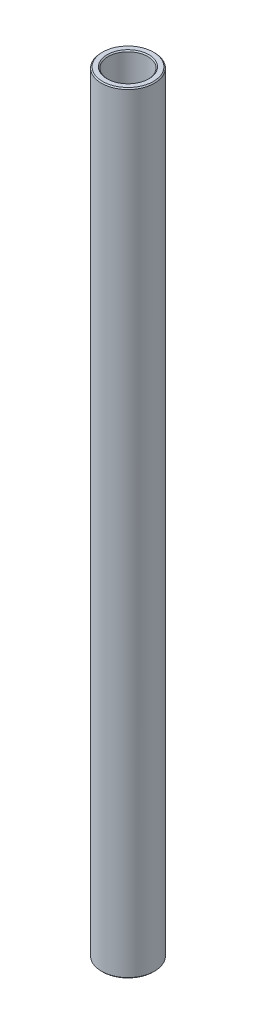
ISO-10303-21;
HEADER;
FILE_DESCRIPTION(('STEP AP214'),'2;1');
FILE_NAME('part.step','',(''),(''),'','','');
FILE_SCHEMA(('AUTOMOTIVE_DESIGN { 1 0 10303 214 1 1 1 1 }'));
ENDSEC;
DATA;
#1=APPLICATION_CONTEXT('core data for automotive mechanical design processes');
#2=APPLICATION_PROTOCOL_DEFINITION('international standard','automotive_design',2000,#1);
#3=PRODUCT_CONTEXT('',#1,'mechanical');
#4=PRODUCT('Part','Part','',(#3));
#5=PRODUCT_RELATED_PRODUCT_CATEGORY('part','',(#4));
#6=PRODUCT_DEFINITION_FORMATION('','',#4);
#7=PRODUCT_DEFINITION_CONTEXT('part definition',#1,'design');
#8=PRODUCT_DEFINITION('design','',#6,#7);
#9=PRODUCT_DEFINITION_SHAPE('','',#8);
#10=(LENGTH_UNIT() NAMED_UNIT(*) SI_UNIT(.MILLI.,.METRE.));
#11=(NAMED_UNIT(*) PLANE_ANGLE_UNIT() SI_UNIT($,.RADIAN.));
#12=(NAMED_UNIT(*) SI_UNIT($,.STERADIAN.) SOLID_ANGLE_UNIT());
#13=UNCERTAINTY_MEASURE_WITH_UNIT(LENGTH_MEASURE(1.E-05),#10,'distance_accuracy_value','');
#14=(GEOMETRIC_REPRESENTATION_CONTEXT(3) GLOBAL_UNCERTAINTY_ASSIGNED_CONTEXT((#13)) GLOBAL_UNIT_ASSIGNED_CONTEXT((#10,
#11,#12)) REPRESENTATION_CONTEXT('',''));
#15=CARTESIAN_POINT('',(0.,0.,0.));
#16=DIRECTION('',(0.,0.,1.));
#17=DIRECTION('',(1.,0.,0.));
#18=AXIS2_PLACEMENT_3D('',#15,#16,#17);
#19=CARTESIAN_POINT('',(0.,11.60859375,0.));
#20=DIRECTION('',(0.,1.,0.));
#21=DIRECTION('',(-1.,0.,0.));
#22=AXIS2_PLACEMENT_3D('',#19,#20,#21);
#23=CYLINDRICAL_SURFACE('',#22,4.7625);
#24=CARTESIAN_POINT('',(0.,-92.217875,0.));
#25=DIRECTION('',(0.,1.,0.));
#26=DIRECTION('',(-1.,0.,0.));
#27=AXIS2_PLACEMENT_3D('',#24,#25,#26);
#28=CIRCLE('',#27,4.7625);
#29=CARTESIAN_POINT('',(-4.76250000000001,-92.217875,0.));
#30=VERTEX_POINT('',#29);
#31=EDGE_CURVE('E50',#30,#30,#28,.F.);
#32=ORIENTED_EDGE('',*,*,#31,.T.);
#33=EDGE_LOOP('',(#32));
#34=FACE_BOUND('',#33,.T.);
#35=CARTESIAN_POINT('',(0.,92.2178750000001,0.));
#36=DIRECTION('',(0.,-1.,0.));
#37=DIRECTION('',(1.,0.,0.));
#38=AXIS2_PLACEMENT_3D('',#35,#36,#37);
#39=CIRCLE('',#38,4.7625);
#40=CARTESIAN_POINT('',(4.76250000000001,92.2178750000001,0.));
#41=VERTEX_POINT('',#40);
#42=EDGE_CURVE('E53',#41,#41,#39,.F.);
#43=ORIENTED_EDGE('',*,*,#42,.T.);
#44=EDGE_LOOP('',(#43));
#45=FACE_BOUND('',#44,.T.);
#46=ADVANCED_FACE('F30',(#34,#45),#23,.F.);
#47=CARTESIAN_POINT('',(4.76249999999999,92.471875,0.));
#48=DIRECTION('',(0.,-1.,0.));
#49=DIRECTION('',(1.,0.,0.));
#50=AXIS2_PLACEMENT_3D('',#47,#48,#49);
#51=PLANE('',#50);
#52=CARTESIAN_POINT('',(0.,92.471875,0.));
#53=DIRECTION('',(0.,-1.,0.));
#54=DIRECTION('',(1.,0.,0.));
#55=AXIS2_PLACEMENT_3D('',#52,#53,#54);
#56=CIRCLE('',#55,6.09599999999996);
#57=CARTESIAN_POINT('',(6.09599999999997,92.471875,0.));
#58=VERTEX_POINT('',#57);
#59=EDGE_CURVE('E10',#58,#58,#56,.F.);
#60=ORIENTED_EDGE('',*,*,#59,.T.);
#61=EDGE_LOOP('',(#60));
#62=FACE_BOUND('',#61,.T.);
#63=CARTESIAN_POINT('',(0.,92.471875,0.));
#64=DIRECTION('',(0.,-1.,0.));
#65=DIRECTION('',(1.,0.,0.));
#66=AXIS2_PLACEMENT_3D('',#63,#64,#65);
#67=CIRCLE('',#66,5.0164999999999);
#68=CARTESIAN_POINT('',(5.01649999999991,92.471875,0.));
#69=VERTEX_POINT('',#68);
#70=EDGE_CURVE('E37',#69,#69,#67,.T.);
#71=ORIENTED_EDGE('',*,*,#70,.T.);
#72=EDGE_LOOP('',(#71));
#73=FACE_BOUND('',#72,.T.);
#74=ADVANCED_FACE('F76',(#62,#73),#51,.F.);
#75=CARTESIAN_POINT('',(0.,11.60859375,0.));
#76=DIRECTION('',(0.,1.,0.));
#77=DIRECTION('',(-1.,0.,0.));
#78=AXIS2_PLACEMENT_3D('',#75,#76,#77);
#79=CYLINDRICAL_SURFACE('',#78,6.35);
#80=CARTESIAN_POINT('',(0.,-92.2178750000001,0.));
#81=DIRECTION('',(0.,1.,0.));
#82=DIRECTION('',(-1.,0.,0.));
#83=AXIS2_PLACEMENT_3D('',#80,#81,#82);
#84=CIRCLE('',#83,6.35);
#85=CARTESIAN_POINT('',(-6.35000000000001,-92.2178750000001,0.));
#86=VERTEX_POINT('',#85);
#87=EDGE_CURVE('E41',#86,#86,#84,.T.);
#88=ORIENTED_EDGE('',*,*,#87,.T.);
#89=EDGE_LOOP('',(#88));
#90=FACE_BOUND('',#89,.T.);
#91=CARTESIAN_POINT('',(0.,92.217875,0.));
#92=DIRECTION('',(0.,-1.,0.));
#93=DIRECTION('',(1.,0.,0.));
#94=AXIS2_PLACEMENT_3D('',#91,#92,#93);
#95=CIRCLE('',#94,6.35);
#96=CARTESIAN_POINT('',(6.35000000000001,92.217875,0.));
#97=VERTEX_POINT('',#96);
#98=EDGE_CURVE('E45',#97,#97,#95,.T.);
#99=ORIENTED_EDGE('',*,*,#98,.T.);
#100=EDGE_LOOP('',(#99));
#101=FACE_BOUND('',#100,.T.);
#102=ADVANCED_FACE('F73',(#90,#101),#79,.T.);
#103=CARTESIAN_POINT('',(6.35000000000001,-92.471875,0.));
#104=DIRECTION('',(0.,1.,0.));
#105=DIRECTION('',(-1.,0.,0.));
#106=AXIS2_PLACEMENT_3D('',#103,#104,#105);
#107=PLANE('',#106);
#108=CARTESIAN_POINT('',(0.,-92.471875,0.));
#109=DIRECTION('',(0.,1.,0.));
#110=DIRECTION('',(-1.,0.,0.));
#111=AXIS2_PLACEMENT_3D('',#108,#109,#110);
#112=CIRCLE('',#111,5.01650000000003);
#113=CARTESIAN_POINT('',(-5.01650000000004,-92.471875,0.));
#114=VERTEX_POINT('',#113);
#115=EDGE_CURVE('E56',#114,#114,#112,.T.);
#116=ORIENTED_EDGE('',*,*,#115,.T.);
#117=EDGE_LOOP('',(#116));
#118=FACE_BOUND('',#117,.T.);
#119=CARTESIAN_POINT('',(0.,-92.471875,0.));
#120=DIRECTION('',(0.,1.,0.));
#121=DIRECTION('',(-1.,0.,0.));
#122=AXIS2_PLACEMENT_3D('',#119,#120,#121);
#123=CIRCLE('',#122,6.0960000000001);
#124=CARTESIAN_POINT('',(-6.09600000000011,-92.471875,0.));
#125=VERTEX_POINT('',#124);
#126=EDGE_CURVE('E59',#125,#125,#123,.F.);
#127=ORIENTED_EDGE('',*,*,#126,.T.);
#128=EDGE_LOOP('',(#127));
#129=FACE_BOUND('',#128,.T.);
#130=ADVANCED_FACE('F63',(#118,#129),#107,.F.);
#131=CARTESIAN_POINT('',(0.,-92.471875,0.));
#132=DIRECTION('',(0.,-1.,0.));
#133=DIRECTION('',(1.,0.,0.));
#134=AXIS2_PLACEMENT_3D('',#131,#132,#133);
#135=CONICAL_SURFACE('',#134,5.01650000000003,0.785398163397484);
#136=ORIENTED_EDGE('',*,*,#31,.F.);
#137=EDGE_LOOP('',(#136));
#138=FACE_BOUND('',#137,.T.);
#139=ORIENTED_EDGE('',*,*,#115,.F.);
#140=EDGE_LOOP('',(#139));
#141=FACE_BOUND('',#140,.T.);
#142=ADVANCED_FACE('F69',(#138,#141),#135,.F.);
#143=CARTESIAN_POINT('',(0.,-92.2178750000001,0.));
#144=DIRECTION('',(0.,1.,0.));
#145=DIRECTION('',(-1.,0.,0.));
#146=AXIS2_PLACEMENT_3D('',#143,#144,#145);
#147=CONICAL_SURFACE('',#146,6.35,0.785398163397406);
#148=ORIENTED_EDGE('',*,*,#126,.F.);
#149=EDGE_LOOP('',(#148));
#150=FACE_BOUND('',#149,.T.);
#151=ORIENTED_EDGE('',*,*,#87,.F.);
#152=EDGE_LOOP('',(#151));
#153=FACE_BOUND('',#152,.T.);
#154=ADVANCED_FACE('F65',(#150,#153),#147,.T.);
#155=CARTESIAN_POINT('',(0.,92.471875,0.));
#156=DIRECTION('',(0.,-1.,0.));
#157=DIRECTION('',(1.,0.,0.));
#158=AXIS2_PLACEMENT_3D('',#155,#156,#157);
#159=CONICAL_SURFACE('',#158,6.09599999999996,0.78539816339746);
#160=ORIENTED_EDGE('',*,*,#98,.F.);
#161=EDGE_LOOP('',(#160));
#162=FACE_BOUND('',#161,.T.);
#163=ORIENTED_EDGE('',*,*,#59,.F.);
#164=EDGE_LOOP('',(#163));
#165=FACE_BOUND('',#164,.T.);
#166=ADVANCED_FACE('F68',(#162,#165),#159,.T.);
#167=CARTESIAN_POINT('',(0.,92.2178750000001,0.));
#168=DIRECTION('',(0.,1.,0.));
#169=DIRECTION('',(-1.,0.,0.));
#170=AXIS2_PLACEMENT_3D('',#167,#168,#169);
#171=CONICAL_SURFACE('',#170,4.7625,0.78539816339743);
#172=ORIENTED_EDGE('',*,*,#70,.F.);
#173=EDGE_LOOP('',(#172));
#174=FACE_BOUND('',#173,.T.);
#175=ORIENTED_EDGE('',*,*,#42,.F.);
#176=EDGE_LOOP('',(#175));
#177=FACE_BOUND('',#176,.T.);
#178=ADVANCED_FACE('F32',(#174,#177),#171,.F.);
#179=CLOSED_SHELL('',(#46,#74,#102,#130,#142,#154,#166,#178));
#180=MANIFOLD_SOLID_BREP('B2',#179);
#181=ADVANCED_BREP_SHAPE_REPRESENTATION('',(#18,#180),#14);
#182=SHAPE_DEFINITION_REPRESENTATION(#9,#181);
ENDSEC;
END-ISO-10303-21;
